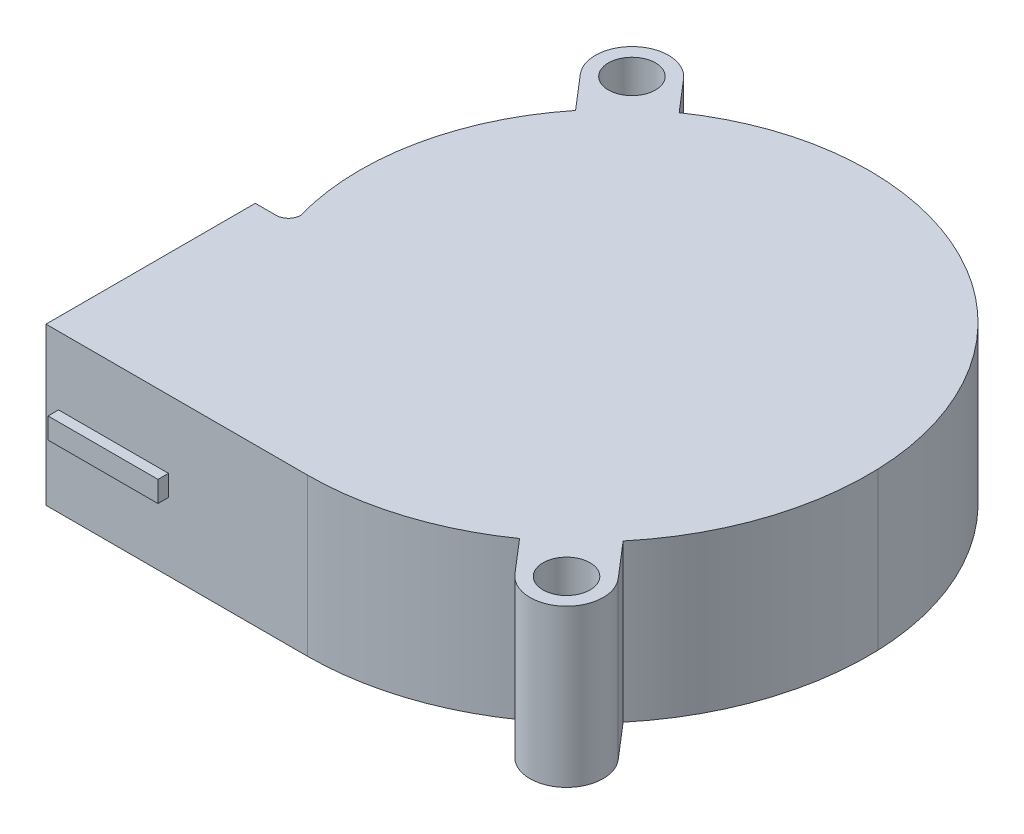
ISO-10303-21;
HEADER;
FILE_DESCRIPTION(('STEP AP214'),'2;1');
FILE_NAME('part.step','',(''),(''),'','','');
FILE_SCHEMA(('AUTOMOTIVE_DESIGN { 1 0 10303 214 1 1 1 1 }'));
ENDSEC;
DATA;
#1=APPLICATION_CONTEXT('core data for automotive mechanical design processes');
#2=APPLICATION_PROTOCOL_DEFINITION('international standard','automotive_design',2000,#1);
#3=PRODUCT_CONTEXT('',#1,'mechanical');
#4=PRODUCT('Part','Part','',(#3));
#5=PRODUCT_RELATED_PRODUCT_CATEGORY('part','',(#4));
#6=PRODUCT_DEFINITION_FORMATION('','',#4);
#7=PRODUCT_DEFINITION_CONTEXT('part definition',#1,'design');
#8=PRODUCT_DEFINITION('design','',#6,#7);
#9=PRODUCT_DEFINITION_SHAPE('','',#8);
#10=(LENGTH_UNIT() NAMED_UNIT(*) SI_UNIT(.MILLI.,.METRE.));
#11=(NAMED_UNIT(*) PLANE_ANGLE_UNIT() SI_UNIT($,.RADIAN.));
#12=(NAMED_UNIT(*) SI_UNIT($,.STERADIAN.) SOLID_ANGLE_UNIT());
#13=UNCERTAINTY_MEASURE_WITH_UNIT(LENGTH_MEASURE(1.E-05),#10,'distance_accuracy_value','');
#14=(GEOMETRIC_REPRESENTATION_CONTEXT(3) GLOBAL_UNCERTAINTY_ASSIGNED_CONTEXT((#13)) GLOBAL_UNIT_ASSIGNED_CONTEXT((#10,
#11,#12)) REPRESENTATION_CONTEXT('',''));
#15=CARTESIAN_POINT('',(0.,0.,0.));
#16=DIRECTION('',(0.,0.,1.));
#17=DIRECTION('',(1.,0.,0.));
#18=AXIS2_PLACEMENT_3D('',#15,#16,#17);
#19=CARTESIAN_POINT('',(0.,-7.5,27.75));
#20=DIRECTION('',(0.,0.,1.));
#21=DIRECTION('',(1.,0.,0.));
#22=AXIS2_PLACEMENT_3D('',#19,#20,#21);
#23=PLANE('',#22);
#24=DIRECTION('',(0.,1.,0.));
#25=VECTOR('',#24,1.);
#26=CARTESIAN_POINT('',(0.,-7.5,27.75));
#27=LINE('',#26,#25);
#28=CARTESIAN_POINT('',(0.,-7.5,27.75));
#29=VERTEX_POINT('',#28);
#30=CARTESIAN_POINT('',(0.,7.5,27.75));
#31=VERTEX_POINT('',#30);
#32=EDGE_CURVE('E484',#29,#31,#27,.T.);
#33=ORIENTED_EDGE('',*,*,#32,.T.);
#34=DIRECTION('',(1.,0.,0.));
#35=VECTOR('',#34,1.);
#36=CARTESIAN_POINT('',(0.,7.5,27.75));
#37=LINE('',#36,#35);
#38=CARTESIAN_POINT('',(-25.,7.5,27.75));
#39=VERTEX_POINT('',#38);
#40=EDGE_CURVE('E371',#39,#31,#37,.T.);
#41=ORIENTED_EDGE('',*,*,#40,.F.);
#42=DIRECTION('',(0.,1.,0.));
#43=VECTOR('',#42,1.);
#44=CARTESIAN_POINT('',(-25.,-7.5,27.75));
#45=LINE('',#44,#43);
#46=CARTESIAN_POINT('',(-25.,-7.5,27.75));
#47=VERTEX_POINT('',#46);
#48=EDGE_CURVE('E486',#47,#39,#45,.T.);
#49=ORIENTED_EDGE('',*,*,#48,.F.);
#50=DIRECTION('',(1.,0.,0.));
#51=VECTOR('',#50,1.);
#52=CARTESIAN_POINT('',(0.,-7.5,27.75));
#53=LINE('',#52,#51);
#54=EDGE_CURVE('E424',#47,#29,#53,.T.);
#55=ORIENTED_EDGE('',*,*,#54,.T.);
#56=EDGE_LOOP('',(#33,#41,#49,#55));
#57=FACE_BOUND('',#56,.T.);
#58=DIRECTION('',(0.,1.,0.));
#59=VECTOR('',#58,1.);
#60=CARTESIAN_POINT('',(-13.3,-1.,27.75));
#61=LINE('',#60,#59);
#62=CARTESIAN_POINT('',(-13.3,-1.,27.75));
#63=VERTEX_POINT('',#62);
#64=CARTESIAN_POINT('',(-13.3,1.,27.75));
#65=VERTEX_POINT('',#64);
#66=EDGE_CURVE('E54',#63,#65,#61,.T.);
#67=ORIENTED_EDGE('',*,*,#66,.F.);
#68=DIRECTION('',(-1.,0.,0.));
#69=VECTOR('',#68,1.);
#70=CARTESIAN_POINT('',(-23.8,-1.,27.75));
#71=LINE('',#70,#69);
#72=CARTESIAN_POINT('',(-23.8,-1.,27.75));
#73=VERTEX_POINT('',#72);
#74=EDGE_CURVE('E49',#63,#73,#71,.T.);
#75=ORIENTED_EDGE('',*,*,#74,.T.);
#76=DIRECTION('',(0.,1.,0.));
#77=VECTOR('',#76,1.);
#78=CARTESIAN_POINT('',(-23.8,-1.,27.75));
#79=LINE('',#78,#77);
#80=CARTESIAN_POINT('',(-23.8,1.,27.75));
#81=VERTEX_POINT('',#80);
#82=EDGE_CURVE('E232',#73,#81,#79,.T.);
#83=ORIENTED_EDGE('',*,*,#82,.T.);
#84=DIRECTION('',(-1.,0.,0.));
#85=VECTOR('',#84,1.);
#86=CARTESIAN_POINT('',(-23.8,1.,27.75));
#87=LINE('',#86,#85);
#88=EDGE_CURVE('E221',#65,#81,#87,.T.);
#89=ORIENTED_EDGE('',*,*,#88,.F.);
#90=EDGE_LOOP('',(#67,#75,#83,#89));
#91=FACE_BOUND('',#90,.T.);
#92=ADVANCED_FACE('F34',(#57,#91),#23,.T.);
#93=CARTESIAN_POINT('',(1.28434065934066,-7.5,0.));
#94=DIRECTION('',(0.,1.,0.));
#95=DIRECTION('',(0.,0.,1.));
#96=AXIS2_PLACEMENT_3D('',#93,#94,#95);
#97=CYLINDRICAL_SURFACE('',#96,24.0343406593407);
#98=DIRECTION('',(0.,1.,0.));
#99=VECTOR('',#98,1.);
#100=CARTESIAN_POINT('',(-22.3712512996283,-2.,4.25));
#101=LINE('',#100,#99);
#102=CARTESIAN_POINT('',(-22.3712512996283,-2.,4.25));
#103=VERTEX_POINT('',#102);
#104=CARTESIAN_POINT('',(-22.3712512996283,1.,4.25));
#105=VERTEX_POINT('',#104);
#106=EDGE_CURVE('E508',#103,#105,#101,.T.);
#107=ORIENTED_EDGE('',*,*,#106,.F.);
#108=CARTESIAN_POINT('',(1.28434065934066,-2.,0.));
#109=DIRECTION('',(0.,1.,0.));
#110=DIRECTION('',(0.,0.,1.));
#111=AXIS2_PLACEMENT_3D('',#108,#109,#110);
#112=CIRCLE('',#111,24.0343406593407);
#113=CARTESIAN_POINT('',(-22.75,-2.,0.));
#114=VERTEX_POINT('',#113);
#115=EDGE_CURVE('E506',#103,#114,#112,.F.);
#116=ORIENTED_EDGE('',*,*,#115,.T.);
#117=DIRECTION('',(0.,1.,0.));
#118=VECTOR('',#117,1.);
#119=CARTESIAN_POINT('',(-22.75,-7.5,0.));
#120=LINE('',#119,#118);
#121=CARTESIAN_POINT('',(-22.75,-7.5,0.));
#122=VERTEX_POINT('',#121);
#123=EDGE_CURVE('E460',#122,#114,#120,.T.);
#124=ORIENTED_EDGE('',*,*,#123,.F.);
#125=CARTESIAN_POINT('',(1.28434065934066,-7.5,0.));
#126=DIRECTION('',(0.,1.,0.));
#127=DIRECTION('',(0.,0.,1.));
#128=AXIS2_PLACEMENT_3D('',#125,#126,#127);
#129=CIRCLE('',#128,24.0343406593407);
#130=CARTESIAN_POINT('',(-21.8313535095817,-7.5,6.58135350958172));
#131=VERTEX_POINT('',#130);
#132=EDGE_CURVE('E415',#122,#131,#129,.T.);
#133=ORIENTED_EDGE('',*,*,#132,.T.);
#134=DIRECTION('',(0.,1.,0.));
#135=VECTOR('',#134,1.);
#136=CARTESIAN_POINT('',(-21.8313535095817,-7.5,6.58135350958172));
#137=LINE('',#136,#135);
#138=CARTESIAN_POINT('',(-21.8313535095817,7.5,6.58135350958172));
#139=VERTEX_POINT('',#138);
#140=EDGE_CURVE('E357',#131,#139,#137,.T.);
#141=ORIENTED_EDGE('',*,*,#140,.T.);
#142=CARTESIAN_POINT('',(1.28434065934066,7.5,0.));
#143=DIRECTION('',(0.,1.,0.));
#144=DIRECTION('',(0.,0.,1.));
#145=AXIS2_PLACEMENT_3D('',#142,#143,#144);
#146=CIRCLE('',#145,24.0343406593407);
#147=CARTESIAN_POINT('',(-22.75,7.5,0.));
#148=VERTEX_POINT('',#147);
#149=EDGE_CURVE('E367',#148,#139,#146,.T.);
#150=ORIENTED_EDGE('',*,*,#149,.F.);
#151=CARTESIAN_POINT('',(-22.75,1.,0.));
#152=VERTEX_POINT('',#151);
#153=EDGE_CURVE('E463',#152,#148,#120,.T.);
#154=ORIENTED_EDGE('',*,*,#153,.F.);
#155=CARTESIAN_POINT('',(1.28434065934066,1.,0.));
#156=DIRECTION('',(0.,1.,0.));
#157=DIRECTION('',(0.,0.,1.));
#158=AXIS2_PLACEMENT_3D('',#155,#156,#157);
#159=CIRCLE('',#158,24.0343406593407);
#160=EDGE_CURVE('E495',#105,#152,#159,.F.);
#161=ORIENTED_EDGE('',*,*,#160,.F.);
#162=EDGE_LOOP('',(#107,#116,#124,#133,#141,#150,#154,#161));
#163=FACE_BOUND('',#162,.T.);
#164=ADVANCED_FACE('F36',(#163),#97,.T.);
#165=CARTESIAN_POINT('',(1.54945054945054,-7.5,0.));
#166=DIRECTION('',(0.,1.,0.));
#167=DIRECTION('',(0.,0.,1.));
#168=AXIS2_PLACEMENT_3D('',#165,#166,#167);
#169=CYLINDRICAL_SURFACE('',#168,24.2994505494505);
#170=ORIENTED_EDGE('',*,*,#123,.T.);
#171=CARTESIAN_POINT('',(1.54945054945054,-2.,0.));
#172=DIRECTION('',(0.,1.,0.));
#173=DIRECTION('',(0.,0.,1.));
#174=AXIS2_PLACEMENT_3D('',#171,#172,#173);
#175=CIRCLE('',#174,24.2994505494505);
#176=CARTESIAN_POINT('',(-22.3754485518036,-2.,-4.25));
#177=VERTEX_POINT('',#176);
#178=EDGE_CURVE('E11',#114,#177,#175,.F.);
#179=ORIENTED_EDGE('',*,*,#178,.T.);
#180=DIRECTION('',(0.,1.,0.));
#181=VECTOR('',#180,1.);
#182=CARTESIAN_POINT('',(-22.3754485518036,-2.,-4.25));
#183=LINE('',#182,#181);
#184=CARTESIAN_POINT('',(-22.3754485518036,1.,-4.25));
#185=VERTEX_POINT('',#184);
#186=EDGE_CURVE('E500',#177,#185,#183,.T.);
#187=ORIENTED_EDGE('',*,*,#186,.T.);
#188=CARTESIAN_POINT('',(1.54945054945054,1.,0.));
#189=DIRECTION('',(0.,1.,0.));
#190=DIRECTION('',(0.,0.,1.));
#191=AXIS2_PLACEMENT_3D('',#188,#189,#190);
#192=CIRCLE('',#191,24.2994505494505);
#193=EDGE_CURVE('E42',#152,#185,#192,.F.);
#194=ORIENTED_EDGE('',*,*,#193,.F.);
#195=ORIENTED_EDGE('',*,*,#153,.T.);
#196=CARTESIAN_POINT('',(1.54945054945054,7.5,0.));
#197=DIRECTION('',(0.,1.,0.));
#198=DIRECTION('',(0.,0.,-1.));
#199=AXIS2_PLACEMENT_3D('',#196,#197,#198);
#200=CIRCLE('',#199,24.2994505494505);
#201=CARTESIAN_POINT('',(-17.377967792775,7.5,-15.2386394374162));
#202=VERTEX_POINT('',#201);
#203=EDGE_CURVE('E407',#202,#148,#200,.T.);
#204=ORIENTED_EDGE('',*,*,#203,.F.);
#205=DIRECTION('',(0.,1.,0.));
#206=VECTOR('',#205,1.);
#207=CARTESIAN_POINT('',(-17.377967792775,-7.5,-15.2386394374162));
#208=LINE('',#207,#206);
#209=CARTESIAN_POINT('',(-17.377967792775,-7.5,-15.2386394374162));
#210=VERTEX_POINT('',#209);
#211=EDGE_CURVE('E464',#210,#202,#208,.T.);
#212=ORIENTED_EDGE('',*,*,#211,.F.);
#213=CARTESIAN_POINT('',(1.54945054945054,-7.5,0.));
#214=DIRECTION('',(0.,1.,0.));
#215=DIRECTION('',(0.,0.,-1.));
#216=AXIS2_PLACEMENT_3D('',#213,#214,#215);
#217=CIRCLE('',#216,24.2994505494505);
#218=EDGE_CURVE('E457',#210,#122,#217,.T.);
#219=ORIENTED_EDGE('',*,*,#218,.T.);
#220=EDGE_LOOP('',(#170,#179,#187,#194,#195,#204,#212,#219));
#221=FACE_BOUND('',#220,.T.);
#222=ADVANCED_FACE('F287',(#221),#169,.T.);
#223=CARTESIAN_POINT('',(-20.1542378361623,-7.5,-18.4685483767819));
#224=DIRECTION('',(-0.758353667474934,0.,0.651843320919466));
#225=DIRECTION('',(0.651843320919466,0.,0.758353667474934));
#226=AXIS2_PLACEMENT_3D('',#223,#224,#225);
#227=PLANE('',#226);
#228=ORIENTED_EDGE('',*,*,#211,.T.);
#229=DIRECTION('',(0.651843320919466,0.,0.758353667474934));
#230=VECTOR('',#229,1.);
#231=CARTESIAN_POINT('',(-20.1542378361623,7.5,-18.4685483767819));
#232=LINE('',#231,#230);
#233=CARTESIAN_POINT('',(-20.1542378361623,7.5,-18.4685483767819));
#234=VERTEX_POINT('',#233);
#235=EDGE_CURVE('E404',#234,#202,#232,.T.);
#236=ORIENTED_EDGE('',*,*,#235,.F.);
#237=DIRECTION('',(0.,1.,0.));
#238=VECTOR('',#237,1.);
#239=CARTESIAN_POINT('',(-20.1542378361623,-7.5,-18.4685483767819));
#240=LINE('',#239,#238);
#241=CARTESIAN_POINT('',(-20.1542378361623,-7.5,-18.4685483767819));
#242=VERTEX_POINT('',#241);
#243=EDGE_CURVE('E466',#242,#234,#240,.T.);
#244=ORIENTED_EDGE('',*,*,#243,.F.);
#245=DIRECTION('',(0.651843320919466,0.,0.758353667474934));
#246=VECTOR('',#245,1.);
#247=CARTESIAN_POINT('',(-20.1542378361623,-7.5,-18.4685483767819));
#248=LINE('',#247,#246);
#249=EDGE_CURVE('E454',#242,#210,#248,.T.);
#250=ORIENTED_EDGE('',*,*,#249,.T.);
#251=EDGE_LOOP('',(#228,#236,#244,#250));
#252=FACE_BOUND('',#251,.T.);
#253=ADVANCED_FACE('F290',(#252),#227,.T.);
#254=CARTESIAN_POINT('',(-17.5,-7.5,-20.75));
#255=DIRECTION('',(0.,1.,0.));
#256=DIRECTION('',(0.,0.,1.));
#257=AXIS2_PLACEMENT_3D('',#254,#255,#256);
#258=CYLINDRICAL_SURFACE('',#257,3.5);
#259=ORIENTED_EDGE('',*,*,#243,.T.);
#260=CARTESIAN_POINT('',(-17.5,7.5,-20.75));
#261=DIRECTION('',(0.,1.,0.));
#262=DIRECTION('',(0.,0.,1.));
#263=AXIS2_PLACEMENT_3D('',#260,#261,#262);
#264=CIRCLE('',#263,3.5);
#265=CARTESIAN_POINT('',(-14.8457621638377,7.5,-23.0314516232181));
#266=VERTEX_POINT('',#265);
#267=EDGE_CURVE('E401',#266,#234,#264,.T.);
#268=ORIENTED_EDGE('',*,*,#267,.F.);
#269=DIRECTION('',(0.,1.,0.));
#270=VECTOR('',#269,1.);
#271=CARTESIAN_POINT('',(-14.8457621638377,-7.5,-23.0314516232181));
#272=LINE('',#271,#270);
#273=CARTESIAN_POINT('',(-14.8457621638377,-7.5,-23.0314516232181));
#274=VERTEX_POINT('',#273);
#275=EDGE_CURVE('E468',#274,#266,#272,.T.);
#276=ORIENTED_EDGE('',*,*,#275,.F.);
#277=CARTESIAN_POINT('',(-17.5,-7.5,-20.75));
#278=DIRECTION('',(0.,1.,0.));
#279=DIRECTION('',(0.,0.,1.));
#280=AXIS2_PLACEMENT_3D('',#277,#278,#279);
#281=CIRCLE('',#280,3.5);
#282=EDGE_CURVE('E451',#274,#242,#281,.T.);
#283=ORIENTED_EDGE('',*,*,#282,.T.);
#284=EDGE_LOOP('',(#259,#268,#276,#283));
#285=FACE_BOUND('',#284,.T.);
#286=ADVANCED_FACE('F294',(#285),#258,.T.);
#287=CARTESIAN_POINT('',(-14.8457621638377,-7.5,-23.0314516232181));
#288=DIRECTION('',(0.758353667474934,0.,-0.651843320919466));
#289=DIRECTION('',(-0.651843320919466,0.,-0.758353667474934));
#290=AXIS2_PLACEMENT_3D('',#287,#288,#289);
#291=PLANE('',#290);
#292=ORIENTED_EDGE('',*,*,#275,.T.);
#293=DIRECTION('',(-0.651843320919466,0.,-0.758353667474934));
#294=VECTOR('',#293,1.);
#295=CARTESIAN_POINT('',(-14.8457621638377,7.5,-23.0314516232181));
#296=LINE('',#295,#294);
#297=CARTESIAN_POINT('',(-12.2442886819954,7.5,-20.0049007750617));
#298=VERTEX_POINT('',#297);
#299=EDGE_CURVE('E398',#298,#266,#296,.T.);
#300=ORIENTED_EDGE('',*,*,#299,.F.);
#301=DIRECTION('',(0.,1.,0.));
#302=VECTOR('',#301,1.);
#303=CARTESIAN_POINT('',(-12.2442886819954,-7.5,-20.0049007750617));
#304=LINE('',#303,#302);
#305=CARTESIAN_POINT('',(-12.2442886819954,-7.5,-20.0049007750617));
#306=VERTEX_POINT('',#305);
#307=EDGE_CURVE('E470',#306,#298,#304,.T.);
#308=ORIENTED_EDGE('',*,*,#307,.F.);
#309=DIRECTION('',(-0.651843320919466,0.,-0.758353667474934));
#310=VECTOR('',#309,1.);
#311=CARTESIAN_POINT('',(-14.8457621638377,-7.5,-23.0314516232181));
#312=LINE('',#311,#310);
#313=EDGE_CURVE('E448',#306,#274,#312,.T.);
#314=ORIENTED_EDGE('',*,*,#313,.T.);
#315=EDGE_LOOP('',(#292,#300,#308,#314));
#316=FACE_BOUND('',#315,.T.);
#317=ADVANCED_FACE('F298',(#316),#291,.T.);
#318=CARTESIAN_POINT('',(1.54945054945054,-7.5,0.));
#319=DIRECTION('',(0.,1.,0.));
#320=DIRECTION('',(0.,0.,1.));
#321=AXIS2_PLACEMENT_3D('',#318,#319,#320);
#322=CYLINDRICAL_SURFACE('',#321,24.2994505494505);
#323=ORIENTED_EDGE('',*,*,#307,.T.);
#324=CARTESIAN_POINT('',(1.54945054945054,7.5,0.));
#325=DIRECTION('',(0.,1.,0.));
#326=DIRECTION('',(0.,0.,-1.));
#327=AXIS2_PLACEMENT_3D('',#324,#325,#326);
#328=CIRCLE('',#327,24.2994505494505);
#329=CARTESIAN_POINT('',(0.,7.5,-24.25));
#330=VERTEX_POINT('',#329);
#331=EDGE_CURVE('E395',#330,#298,#328,.T.);
#332=ORIENTED_EDGE('',*,*,#331,.F.);
#333=DIRECTION('',(0.,1.,0.));
#334=VECTOR('',#333,1.);
#335=CARTESIAN_POINT('',(0.,-7.5,-24.25));
#336=LINE('',#335,#334);
#337=CARTESIAN_POINT('',(0.,-7.5,-24.25));
#338=VERTEX_POINT('',#337);
#339=EDGE_CURVE('E472',#338,#330,#336,.T.);
#340=ORIENTED_EDGE('',*,*,#339,.F.);
#341=CARTESIAN_POINT('',(1.54945054945054,-7.5,0.));
#342=DIRECTION('',(0.,1.,0.));
#343=DIRECTION('',(0.,0.,-1.));
#344=AXIS2_PLACEMENT_3D('',#341,#342,#343);
#345=CIRCLE('',#344,24.2994505494505);
#346=EDGE_CURVE('E445',#338,#306,#345,.T.);
#347=ORIENTED_EDGE('',*,*,#346,.T.);
#348=EDGE_LOOP('',(#323,#332,#340,#347));
#349=FACE_BOUND('',#348,.T.);
#350=ADVANCED_FACE('F302',(#349),#322,.T.);
#351=CARTESIAN_POINT('',(1.60434425415708,-7.5,0.859125410362815));
#352=DIRECTION('',(0.,1.,0.));
#353=DIRECTION('',(0.,0.,1.));
#354=AXIS2_PLACEMENT_3D('',#351,#352,#353);
#355=CYLINDRICAL_SURFACE('',#354,25.1603278865593);
#356=ORIENTED_EDGE('',*,*,#339,.T.);
#357=CARTESIAN_POINT('',(1.60434425415708,7.5,0.859125410362815));
#358=DIRECTION('',(0.,1.,0.));
#359=DIRECTION('',(0.,0.,-1.));
#360=AXIS2_PLACEMENT_3D('',#357,#358,#359);
#361=CIRCLE('',#360,25.1603278865593);
#362=CARTESIAN_POINT('',(26.75,7.5,0.));
#363=VERTEX_POINT('',#362);
#364=EDGE_CURVE('E392',#363,#330,#361,.T.);
#365=ORIENTED_EDGE('',*,*,#364,.F.);
#366=DIRECTION('',(0.,1.,0.));
#367=VECTOR('',#366,1.);
#368=CARTESIAN_POINT('',(26.75,-7.5,0.));
#369=LINE('',#368,#367);
#370=CARTESIAN_POINT('',(26.75,-7.5,0.));
#371=VERTEX_POINT('',#370);
#372=EDGE_CURVE('E474',#371,#363,#369,.T.);
#373=ORIENTED_EDGE('',*,*,#372,.F.);
#374=CARTESIAN_POINT('',(1.60434425415708,-7.5,0.859125410362815));
#375=DIRECTION('',(0.,1.,0.));
#376=DIRECTION('',(0.,0.,-1.));
#377=AXIS2_PLACEMENT_3D('',#374,#375,#376);
#378=CIRCLE('',#377,25.1603278865593);
#379=EDGE_CURVE('E442',#371,#338,#378,.T.);
#380=ORIENTED_EDGE('',*,*,#379,.T.);
#381=EDGE_LOOP('',(#356,#365,#373,#380));
#382=FACE_BOUND('',#381,.T.);
#383=ADVANCED_FACE('F306',(#382),#355,.T.);
#384=CARTESIAN_POINT('',(-0.0681700971297411,-7.5,0.916268464928992));
#385=DIRECTION('',(0.,1.,0.));
#386=DIRECTION('',(0.,0.,1.));
#387=AXIS2_PLACEMENT_3D('',#384,#385,#386);
#388=CYLINDRICAL_SURFACE('',#387,26.8338181267297);
#389=ORIENTED_EDGE('',*,*,#372,.T.);
#390=CARTESIAN_POINT('',(-0.0681700971297411,7.5,0.916268464928992));
#391=DIRECTION('',(0.,1.,0.));
#392=DIRECTION('',(0.,0.,-1.));
#393=AXIS2_PLACEMENT_3D('',#390,#391,#392);
#394=CIRCLE('',#393,26.8338181267297);
#395=CARTESIAN_POINT('',(20.5255717911937,7.5,18.1195120630276));
#396=VERTEX_POINT('',#395);
#397=EDGE_CURVE('E389',#396,#363,#394,.T.);
#398=ORIENTED_EDGE('',*,*,#397,.F.);
#399=DIRECTION('',(0.,1.,0.));
#400=VECTOR('',#399,1.);
#401=CARTESIAN_POINT('',(20.5255717911937,-7.5,18.1195120630276));
#402=LINE('',#401,#400);
#403=CARTESIAN_POINT('',(20.5255717911937,-7.5,18.1195120630276));
#404=VERTEX_POINT('',#403);
#405=EDGE_CURVE('E476',#404,#396,#402,.T.);
#406=ORIENTED_EDGE('',*,*,#405,.F.);
#407=CARTESIAN_POINT('',(-0.0681700971297411,-7.5,0.916268464928992));
#408=DIRECTION('',(0.,1.,0.));
#409=DIRECTION('',(0.,0.,-1.));
#410=AXIS2_PLACEMENT_3D('',#407,#408,#409);
#411=CIRCLE('',#410,26.8338181267297);
#412=EDGE_CURVE('E439',#404,#371,#411,.T.);
#413=ORIENTED_EDGE('',*,*,#412,.T.);
#414=EDGE_LOOP('',(#389,#398,#406,#413));
#415=FACE_BOUND('',#414,.T.);
#416=ADVANCED_FACE('F310',(#415),#388,.T.);
#417=CARTESIAN_POINT('',(20.5255717911937,-7.5,18.1195120630276));
#418=DIRECTION('',(0.758353667474934,0.,-0.651843320919465));
#419=DIRECTION('',(-0.651843320919466,0.,-0.758353667474934));
#420=AXIS2_PLACEMENT_3D('',#417,#418,#419);
#421=PLANE('',#420);
#422=ORIENTED_EDGE('',*,*,#405,.T.);
#423=DIRECTION('',(-0.651843320919466,0.,-0.758353667474934));
#424=VECTOR('',#423,1.);
#425=CARTESIAN_POINT('',(20.5255717911937,7.5,18.1195120630276));
#426=LINE('',#425,#424);
#427=CARTESIAN_POINT('',(23.4042378361623,7.5,21.4685483767819));
#428=VERTEX_POINT('',#427);
#429=EDGE_CURVE('E386',#428,#396,#426,.T.);
#430=ORIENTED_EDGE('',*,*,#429,.F.);
#431=DIRECTION('',(0.,1.,0.));
#432=VECTOR('',#431,1.);
#433=CARTESIAN_POINT('',(23.4042378361623,-7.5,21.4685483767819));
#434=LINE('',#433,#432);
#435=CARTESIAN_POINT('',(23.4042378361623,-7.5,21.4685483767819));
#436=VERTEX_POINT('',#435);
#437=EDGE_CURVE('E478',#436,#428,#434,.T.);
#438=ORIENTED_EDGE('',*,*,#437,.F.);
#439=DIRECTION('',(-0.651843320919466,0.,-0.758353667474934));
#440=VECTOR('',#439,1.);
#441=CARTESIAN_POINT('',(20.5255717911937,-7.5,18.1195120630276));
#442=LINE('',#441,#440);
#443=EDGE_CURVE('E436',#436,#404,#442,.T.);
#444=ORIENTED_EDGE('',*,*,#443,.T.);
#445=EDGE_LOOP('',(#422,#430,#438,#444));
#446=FACE_BOUND('',#445,.T.);
#447=ADVANCED_FACE('F314',(#446),#421,.T.);
#448=CARTESIAN_POINT('',(20.75,-7.5,23.75));
#449=DIRECTION('',(0.,1.,0.));
#450=DIRECTION('',(0.,0.,1.));
#451=AXIS2_PLACEMENT_3D('',#448,#449,#450);
#452=CYLINDRICAL_SURFACE('',#451,3.5);
#453=ORIENTED_EDGE('',*,*,#437,.T.);
#454=CARTESIAN_POINT('',(20.75,7.5,23.75));
#455=DIRECTION('',(0.,1.,0.));
#456=DIRECTION('',(0.,0.,1.));
#457=AXIS2_PLACEMENT_3D('',#454,#455,#456);
#458=CIRCLE('',#457,3.5);
#459=CARTESIAN_POINT('',(18.0957621638377,7.5,26.0314516232181));
#460=VERTEX_POINT('',#459);
#461=EDGE_CURVE('E383',#460,#428,#458,.T.);
#462=ORIENTED_EDGE('',*,*,#461,.F.);
#463=DIRECTION('',(0.,1.,0.));
#464=VECTOR('',#463,1.);
#465=CARTESIAN_POINT('',(18.0957621638377,-7.5,26.0314516232181));
#466=LINE('',#465,#464);
#467=CARTESIAN_POINT('',(18.0957621638377,-7.5,26.0314516232181));
#468=VERTEX_POINT('',#467);
#469=EDGE_CURVE('E480',#468,#460,#466,.T.);
#470=ORIENTED_EDGE('',*,*,#469,.F.);
#471=CARTESIAN_POINT('',(20.75,-7.5,23.75));
#472=DIRECTION('',(0.,1.,0.));
#473=DIRECTION('',(0.,0.,1.));
#474=AXIS2_PLACEMENT_3D('',#471,#472,#473);
#475=CIRCLE('',#474,3.5);
#476=EDGE_CURVE('E433',#468,#436,#475,.T.);
#477=ORIENTED_EDGE('',*,*,#476,.T.);
#478=EDGE_LOOP('',(#453,#462,#470,#477));
#479=FACE_BOUND('',#478,.T.);
#480=ADVANCED_FACE('F318',(#479),#452,.T.);
#481=CARTESIAN_POINT('',(15.3721482158609,-7.5,22.8628027164215));
#482=DIRECTION('',(-0.758353667474934,0.,0.651843320919465));
#483=DIRECTION('',(0.651843320919465,0.,0.758353667474934));
#484=AXIS2_PLACEMENT_3D('',#481,#482,#483);
#485=PLANE('',#484);
#486=ORIENTED_EDGE('',*,*,#469,.T.);
#487=DIRECTION('',(0.651843320919465,0.,0.758353667474934));
#488=VECTOR('',#487,1.);
#489=CARTESIAN_POINT('',(15.3721482158609,7.5,22.8628027164215));
#490=LINE('',#489,#488);
#491=CARTESIAN_POINT('',(15.3721482158609,7.5,22.8628027164215));
#492=VERTEX_POINT('',#491);
#493=EDGE_CURVE('E380',#492,#460,#490,.T.);
#494=ORIENTED_EDGE('',*,*,#493,.F.);
#495=DIRECTION('',(0.,1.,0.));
#496=VECTOR('',#495,1.);
#497=CARTESIAN_POINT('',(15.3721482158609,-7.5,22.8628027164215));
#498=LINE('',#497,#496);
#499=CARTESIAN_POINT('',(15.3721482158609,-7.5,22.8628027164215));
#500=VERTEX_POINT('',#499);
#501=EDGE_CURVE('E482',#500,#492,#498,.T.);
#502=ORIENTED_EDGE('',*,*,#501,.F.);
#503=DIRECTION('',(0.651843320919465,0.,0.758353667474934));
#504=VECTOR('',#503,1.);
#505=CARTESIAN_POINT('',(15.3721482158609,-7.5,22.8628027164215));
#506=LINE('',#505,#504);
#507=EDGE_CURVE('E430',#500,#468,#506,.T.);
#508=ORIENTED_EDGE('',*,*,#507,.T.);
#509=EDGE_LOOP('',(#486,#494,#502,#508));
#510=FACE_BOUND('',#509,.T.);
#511=ADVANCED_FACE('F322',(#510),#485,.T.);
#512=CARTESIAN_POINT('',(-0.0681700971297411,-7.5,0.916268464928992));
#513=DIRECTION('',(0.,1.,0.));
#514=DIRECTION('',(0.,0.,1.));
#515=AXIS2_PLACEMENT_3D('',#512,#513,#514);
#516=CYLINDRICAL_SURFACE('',#515,26.8338181267297);
#517=ORIENTED_EDGE('',*,*,#501,.T.);
#518=CARTESIAN_POINT('',(-0.0681700971297411,7.5,0.916268464928992));
#519=DIRECTION('',(0.,1.,0.));
#520=DIRECTION('',(0.,0.,-1.));
#521=AXIS2_PLACEMENT_3D('',#518,#519,#520);
#522=CIRCLE('',#521,26.8338181267297);
#523=EDGE_CURVE('E377',#31,#492,#522,.T.);
#524=ORIENTED_EDGE('',*,*,#523,.F.);
#525=ORIENTED_EDGE('',*,*,#32,.F.);
#526=CARTESIAN_POINT('',(-0.0681700971297411,-7.5,0.916268464928992));
#527=DIRECTION('',(0.,1.,0.));
#528=DIRECTION('',(0.,0.,-1.));
#529=AXIS2_PLACEMENT_3D('',#526,#527,#528);
#530=CIRCLE('',#529,26.8338181267297);
#531=EDGE_CURVE('E427',#29,#500,#530,.T.);
#532=ORIENTED_EDGE('',*,*,#531,.T.);
#533=EDGE_LOOP('',(#517,#524,#525,#532));
#534=FACE_BOUND('',#533,.T.);
#535=ADVANCED_FACE('F326',(#534),#516,.T.);
#536=CARTESIAN_POINT('',(-25.,-7.5,27.75));
#537=DIRECTION('',(-1.,0.,0.));
#538=DIRECTION('',(0.,0.,1.));
#539=AXIS2_PLACEMENT_3D('',#536,#537,#538);
#540=PLANE('',#539);
#541=ORIENTED_EDGE('',*,*,#48,.T.);
#542=DIRECTION('',(0.,0.,1.));
#543=VECTOR('',#542,1.);
#544=CARTESIAN_POINT('',(-25.,7.5,27.75));
#545=LINE('',#544,#543);
#546=CARTESIAN_POINT('',(-25.,7.5,7.75));
#547=VERTEX_POINT('',#546);
#548=EDGE_CURVE('E369',#547,#39,#545,.T.);
#549=ORIENTED_EDGE('',*,*,#548,.F.);
#550=DIRECTION('',(0.,1.,0.));
#551=VECTOR('',#550,1.);
#552=CARTESIAN_POINT('',(-25.,-7.5,7.75));
#553=LINE('',#552,#551);
#554=CARTESIAN_POINT('',(-25.,-7.5,7.75));
#555=VERTEX_POINT('',#554);
#556=EDGE_CURVE('E356',#555,#547,#553,.T.);
#557=ORIENTED_EDGE('',*,*,#556,.F.);
#558=DIRECTION('',(0.,0.,1.));
#559=VECTOR('',#558,1.);
#560=CARTESIAN_POINT('',(-25.,-7.5,27.75));
#561=LINE('',#560,#559);
#562=EDGE_CURVE('E421',#555,#47,#561,.T.);
#563=ORIENTED_EDGE('',*,*,#562,.T.);
#564=EDGE_LOOP('',(#541,#549,#557,#563));
#565=FACE_BOUND('',#564,.T.);
#566=ADVANCED_FACE('F330',(#565),#540,.T.);
#567=CARTESIAN_POINT('',(-23.,-7.5,7.75));
#568=DIRECTION('',(0.,0.,-1.));
#569=DIRECTION('',(-1.,0.,0.));
#570=AXIS2_PLACEMENT_3D('',#567,#568,#569);
#571=PLANE('',#570);
#572=ORIENTED_EDGE('',*,*,#556,.T.);
#573=DIRECTION('',(-1.,0.,0.));
#574=VECTOR('',#573,1.);
#575=CARTESIAN_POINT('',(-23.,7.5,7.75));
#576=LINE('',#575,#574);
#577=CARTESIAN_POINT('',(-23.,7.5,7.75));
#578=VERTEX_POINT('',#577);
#579=EDGE_CURVE('E363',#578,#547,#576,.T.);
#580=ORIENTED_EDGE('',*,*,#579,.F.);
#581=DIRECTION('',(0.,1.,0.));
#582=VECTOR('',#581,1.);
#583=CARTESIAN_POINT('',(-23.,-7.5,7.75));
#584=LINE('',#583,#582);
#585=CARTESIAN_POINT('',(-23.,-7.5,7.75));
#586=VERTEX_POINT('',#585);
#587=EDGE_CURVE('E347',#586,#578,#584,.T.);
#588=ORIENTED_EDGE('',*,*,#587,.F.);
#589=DIRECTION('',(-1.,0.,0.));
#590=VECTOR('',#589,1.);
#591=CARTESIAN_POINT('',(-23.,-7.5,7.75));
#592=LINE('',#591,#590);
#593=EDGE_CURVE('E419',#586,#555,#592,.T.);
#594=ORIENTED_EDGE('',*,*,#593,.T.);
#595=EDGE_LOOP('',(#572,#580,#588,#594));
#596=FACE_BOUND('',#595,.T.);
#597=ADVANCED_FACE('F337',(#596),#571,.T.);
#598=CARTESIAN_POINT('',(-23.,-7.5,6.58135350958172));
#599=DIRECTION('',(0.,1.,0.));
#600=DIRECTION('',(0.,0.,1.));
#601=AXIS2_PLACEMENT_3D('',#598,#599,#600);
#602=CYLINDRICAL_SURFACE('',#601,1.16864649041828);
#603=ORIENTED_EDGE('',*,*,#587,.T.);
#604=CARTESIAN_POINT('',(-23.,7.5,6.58135350958172));
#605=DIRECTION('',(0.,-1.,0.));
#606=DIRECTION('',(0.,0.,1.));
#607=AXIS2_PLACEMENT_3D('',#604,#605,#606);
#608=CIRCLE('',#607,1.16864649041828);
#609=EDGE_CURVE('E349',#139,#578,#608,.T.);
#610=ORIENTED_EDGE('',*,*,#609,.F.);
#611=ORIENTED_EDGE('',*,*,#140,.F.);
#612=CARTESIAN_POINT('',(-23.,-7.5,6.58135350958172));
#613=DIRECTION('',(0.,-1.,0.));
#614=DIRECTION('',(0.,0.,1.));
#615=AXIS2_PLACEMENT_3D('',#612,#613,#614);
#616=CIRCLE('',#615,1.16864649041828);
#617=EDGE_CURVE('E352',#131,#586,#616,.T.);
#618=ORIENTED_EDGE('',*,*,#617,.T.);
#619=EDGE_LOOP('',(#603,#610,#611,#618));
#620=FACE_BOUND('',#619,.T.);
#621=ADVANCED_FACE('F285',(#620),#602,.F.);
#622=CARTESIAN_POINT('',(1.28434065934066,-7.5,0.));
#623=DIRECTION('',(0.,1.,0.));
#624=DIRECTION('',(0.,0.,1.));
#625=AXIS2_PLACEMENT_3D('',#622,#623,#624);
#626=PLANE('',#625);
#627=CARTESIAN_POINT('',(20.75,-7.5,23.75));
#628=DIRECTION('',(0.,1.,0.));
#629=DIRECTION('',(0.,0.,1.));
#630=AXIS2_PLACEMENT_3D('',#627,#628,#629);
#631=CIRCLE('',#630,2.25);
#632=CARTESIAN_POINT('',(20.75,-7.5,26.));
#633=VERTEX_POINT('',#632);
#634=EDGE_CURVE('E409',#633,#633,#631,.T.);
#635=ORIENTED_EDGE('',*,*,#634,.T.);
#636=EDGE_LOOP('',(#635));
#637=FACE_BOUND('',#636,.T.);
#638=CARTESIAN_POINT('',(-17.5,-7.5,-20.75));
#639=DIRECTION('',(0.,1.,0.));
#640=DIRECTION('',(0.,0.,1.));
#641=AXIS2_PLACEMENT_3D('',#638,#639,#640);
#642=CIRCLE('',#641,2.25);
#643=CARTESIAN_POINT('',(-17.5,-7.5,-18.5));
#644=VERTEX_POINT('',#643);
#645=EDGE_CURVE('E412',#644,#644,#642,.T.);
#646=ORIENTED_EDGE('',*,*,#645,.T.);
#647=EDGE_LOOP('',(#646));
#648=FACE_BOUND('',#647,.T.);
#649=ORIENTED_EDGE('',*,*,#132,.F.);
#650=ORIENTED_EDGE('',*,*,#218,.F.);
#651=ORIENTED_EDGE('',*,*,#249,.F.);
#652=ORIENTED_EDGE('',*,*,#282,.F.);
#653=ORIENTED_EDGE('',*,*,#313,.F.);
#654=ORIENTED_EDGE('',*,*,#346,.F.);
#655=ORIENTED_EDGE('',*,*,#379,.F.);
#656=ORIENTED_EDGE('',*,*,#412,.F.);
#657=ORIENTED_EDGE('',*,*,#443,.F.);
#658=ORIENTED_EDGE('',*,*,#476,.F.);
#659=ORIENTED_EDGE('',*,*,#507,.F.);
#660=ORIENTED_EDGE('',*,*,#531,.F.);
#661=ORIENTED_EDGE('',*,*,#54,.F.);
#662=ORIENTED_EDGE('',*,*,#562,.F.);
#663=ORIENTED_EDGE('',*,*,#593,.F.);
#664=ORIENTED_EDGE('',*,*,#617,.F.);
#665=EDGE_LOOP('',(#649,#650,#651,#652,#653,#654,#655,#656,#657,#658,#659,#660,#661,#662,#663,#664));
#666=FACE_BOUND('',#665,.T.);
#667=ADVANCED_FACE('F281',(#637,#648,#666),#626,.F.);
#668=CARTESIAN_POINT('',(-17.5,-7.5,-20.75));
#669=DIRECTION('',(0.,1.,0.));
#670=DIRECTION('',(0.,0.,1.));
#671=AXIS2_PLACEMENT_3D('',#668,#669,#670);
#672=CYLINDRICAL_SURFACE('',#671,2.25);
#673=ORIENTED_EDGE('',*,*,#645,.F.);
#674=EDGE_LOOP('',(#673));
#675=FACE_BOUND('',#674,.T.);
#676=CARTESIAN_POINT('',(-17.5,7.5,-20.75));
#677=DIRECTION('',(0.,1.,0.));
#678=DIRECTION('',(0.,0.,1.));
#679=AXIS2_PLACEMENT_3D('',#676,#677,#678);
#680=CIRCLE('',#679,2.25);
#681=CARTESIAN_POINT('',(-17.5,7.5,-18.5));
#682=VERTEX_POINT('',#681);
#683=EDGE_CURVE('E519',#682,#682,#680,.T.);
#684=ORIENTED_EDGE('',*,*,#683,.T.);
#685=EDGE_LOOP('',(#684));
#686=FACE_BOUND('',#685,.T.);
#687=ADVANCED_FACE('F277',(#675,#686),#672,.F.);
#688=CARTESIAN_POINT('',(20.75,-7.5,23.75));
#689=DIRECTION('',(0.,1.,0.));
#690=DIRECTION('',(0.,0.,1.));
#691=AXIS2_PLACEMENT_3D('',#688,#689,#690);
#692=CYLINDRICAL_SURFACE('',#691,2.25);
#693=ORIENTED_EDGE('',*,*,#634,.F.);
#694=EDGE_LOOP('',(#693));
#695=FACE_BOUND('',#694,.T.);
#696=CARTESIAN_POINT('',(20.75,7.5,23.75));
#697=DIRECTION('',(0.,1.,0.));
#698=DIRECTION('',(0.,0.,1.));
#699=AXIS2_PLACEMENT_3D('',#696,#697,#698);
#700=CIRCLE('',#699,2.25);
#701=CARTESIAN_POINT('',(20.75,7.5,26.));
#702=VERTEX_POINT('',#701);
#703=EDGE_CURVE('E516',#702,#702,#700,.T.);
#704=ORIENTED_EDGE('',*,*,#703,.T.);
#705=EDGE_LOOP('',(#704));
#706=FACE_BOUND('',#705,.T.);
#707=ADVANCED_FACE('F273',(#695,#706),#692,.F.);
#708=CARTESIAN_POINT('',(1.28434065934066,7.5,0.));
#709=DIRECTION('',(0.,1.,0.));
#710=DIRECTION('',(0.,0.,1.));
#711=AXIS2_PLACEMENT_3D('',#708,#709,#710);
#712=PLANE('',#711);
#713=ORIENTED_EDGE('',*,*,#683,.F.);
#714=EDGE_LOOP('',(#713));
#715=FACE_BOUND('',#714,.T.);
#716=ORIENTED_EDGE('',*,*,#149,.T.);
#717=ORIENTED_EDGE('',*,*,#609,.T.);
#718=ORIENTED_EDGE('',*,*,#579,.T.);
#719=ORIENTED_EDGE('',*,*,#548,.T.);
#720=ORIENTED_EDGE('',*,*,#40,.T.);
#721=ORIENTED_EDGE('',*,*,#523,.T.);
#722=ORIENTED_EDGE('',*,*,#493,.T.);
#723=ORIENTED_EDGE('',*,*,#461,.T.);
#724=ORIENTED_EDGE('',*,*,#429,.T.);
#725=ORIENTED_EDGE('',*,*,#397,.T.);
#726=ORIENTED_EDGE('',*,*,#364,.T.);
#727=ORIENTED_EDGE('',*,*,#331,.T.);
#728=ORIENTED_EDGE('',*,*,#299,.T.);
#729=ORIENTED_EDGE('',*,*,#267,.T.);
#730=ORIENTED_EDGE('',*,*,#235,.T.);
#731=ORIENTED_EDGE('',*,*,#203,.T.);
#732=EDGE_LOOP('',(#716,#717,#718,#719,#720,#721,#722,#723,#724,#725,#726,#727,#728,#729,#730,#731));
#733=FACE_BOUND('',#732,.T.);
#734=ORIENTED_EDGE('',*,*,#703,.F.);
#735=EDGE_LOOP('',(#734));
#736=FACE_BOUND('',#735,.T.);
#737=ADVANCED_FACE('F267',(#715,#733,#736),#712,.T.);
#738=CARTESIAN_POINT('',(-23.3754485518036,-2.,-4.25));
#739=CARTESIAN_POINT('',(-24.1266498934564,-2.,0.000369076510361208));
#740=CARTESIAN_POINT('',(-23.3712512996283,-2.,4.25));
#741=B_SPLINE_CURVE_WITH_KNOTS('',2,(#738,#739,#740),.UNSPECIFIED.,.F.,.F.,(3,3),(0.,1.),.UNSPECIFIED.);
#742=DIRECTION('',(0.,1.,0.));
#743=VECTOR('',#742,1.);
#744=SURFACE_OF_LINEAR_EXTRUSION('',#741,#743);
#745=DIRECTION('',(0.,1.,0.));
#746=VECTOR('',#745,1.);
#747=CARTESIAN_POINT('',(-23.3712512996283,-2.,4.25));
#748=LINE('',#747,#746);
#749=CARTESIAN_POINT('',(-23.3712512996283,-2.,4.25));
#750=VERTEX_POINT('',#749);
#751=CARTESIAN_POINT('',(-23.3712512996283,1.,4.25));
#752=VERTEX_POINT('',#751);
#753=EDGE_CURVE('E513',#750,#752,#748,.T.);
#754=ORIENTED_EDGE('',*,*,#753,.T.);
#755=CARTESIAN_POINT('',(-23.3754485518036,1.,-4.25));
#756=CARTESIAN_POINT('',(-24.1266498934564,1.,0.000369076510361208));
#757=CARTESIAN_POINT('',(-23.3712512996283,1.,4.25));
#758=B_SPLINE_CURVE_WITH_KNOTS('',2,(#755,#756,#757),.UNSPECIFIED.,.F.,.F.,(3,3),(0.,1.),.UNSPECIFIED.);
#759=CARTESIAN_POINT('',(-23.3754485518036,1.,-4.25));
#760=VERTEX_POINT('',#759);
#761=EDGE_CURVE('E234',#760,#752,#758,.T.);
#762=ORIENTED_EDGE('',*,*,#761,.F.);
#763=DIRECTION('',(0.,1.,0.));
#764=VECTOR('',#763,1.);
#765=CARTESIAN_POINT('',(-23.3754485518036,-2.,-4.25));
#766=LINE('',#765,#764);
#767=CARTESIAN_POINT('',(-23.3754485518036,-2.,-4.25));
#768=VERTEX_POINT('',#767);
#769=EDGE_CURVE('E502',#768,#760,#766,.T.);
#770=ORIENTED_EDGE('',*,*,#769,.F.);
#771=EDGE_CURVE('E250',#768,#750,#741,.T.);
#772=ORIENTED_EDGE('',*,*,#771,.T.);
#773=EDGE_LOOP('',(#754,#762,#770,#772));
#774=FACE_BOUND('',#773,.T.);
#775=ADVANCED_FACE('F262',(#774),#744,.T.);
#776=CARTESIAN_POINT('',(-23.3754485518036,-2.,-4.25));
#777=DIRECTION('',(0.,0.,-1.));
#778=DIRECTION('',(-1.,0.,0.));
#779=AXIS2_PLACEMENT_3D('',#776,#777,#778);
#780=PLANE('',#779);
#781=ORIENTED_EDGE('',*,*,#769,.T.);
#782=DIRECTION('',(-1.,0.,0.));
#783=VECTOR('',#782,1.);
#784=CARTESIAN_POINT('',(-23.3754485518036,1.,-4.25));
#785=LINE('',#784,#783);
#786=EDGE_CURVE('E247',#185,#760,#785,.T.);
#787=ORIENTED_EDGE('',*,*,#786,.F.);
#788=ORIENTED_EDGE('',*,*,#186,.F.);
#789=DIRECTION('',(-1.,0.,0.));
#790=VECTOR('',#789,1.);
#791=CARTESIAN_POINT('',(-23.3754485518036,-2.,-4.25));
#792=LINE('',#791,#790);
#793=EDGE_CURVE('E503',#177,#768,#792,.T.);
#794=ORIENTED_EDGE('',*,*,#793,.T.);
#795=EDGE_LOOP('',(#781,#787,#788,#794));
#796=FACE_BOUND('',#795,.T.);
#797=ADVANCED_FACE('F266',(#796),#780,.T.);
#798=CARTESIAN_POINT('',(-23.3712512996283,-2.,4.25));
#799=DIRECTION('',(0.,0.,1.));
#800=DIRECTION('',(1.,0.,0.));
#801=AXIS2_PLACEMENT_3D('',#798,#799,#800);
#802=PLANE('',#801);
#803=ORIENTED_EDGE('',*,*,#106,.T.);
#804=DIRECTION('',(1.,0.,0.));
#805=VECTOR('',#804,1.);
#806=CARTESIAN_POINT('',(-23.3712512996283,1.,4.25));
#807=LINE('',#806,#805);
#808=EDGE_CURVE('E241',#752,#105,#807,.T.);
#809=ORIENTED_EDGE('',*,*,#808,.F.);
#810=ORIENTED_EDGE('',*,*,#753,.F.);
#811=DIRECTION('',(1.,0.,0.));
#812=VECTOR('',#811,1.);
#813=CARTESIAN_POINT('',(-23.3712512996283,-2.,4.25));
#814=LINE('',#813,#812);
#815=EDGE_CURVE('E256',#750,#103,#814,.T.);
#816=ORIENTED_EDGE('',*,*,#815,.T.);
#817=EDGE_LOOP('',(#803,#809,#810,#816));
#818=FACE_BOUND('',#817,.T.);
#819=ADVANCED_FACE('F269',(#818),#802,.T.);
#820=CARTESIAN_POINT('',(-23.7499999095862,-2.,0.000184538255180522));
#821=DIRECTION('',(0.,1.,0.));
#822=DIRECTION('',(0.,0.,1.));
#823=AXIS2_PLACEMENT_3D('',#820,#821,#822);
#824=PLANE('',#823);
#825=ORIENTED_EDGE('',*,*,#115,.F.);
#826=ORIENTED_EDGE('',*,*,#815,.F.);
#827=ORIENTED_EDGE('',*,*,#771,.F.);
#828=ORIENTED_EDGE('',*,*,#793,.F.);
#829=ORIENTED_EDGE('',*,*,#178,.F.);
#830=EDGE_LOOP('',(#825,#826,#827,#828,#829));
#831=FACE_BOUND('',#830,.T.);
#832=ADVANCED_FACE('F533',(#831),#824,.F.);
#833=CARTESIAN_POINT('',(-23.7499999095862,1.,0.000184538255180522));
#834=DIRECTION('',(0.,1.,0.));
#835=DIRECTION('',(0.,0.,1.));
#836=AXIS2_PLACEMENT_3D('',#833,#834,#835);
#837=PLANE('',#836);
#838=ORIENTED_EDGE('',*,*,#808,.T.);
#839=ORIENTED_EDGE('',*,*,#160,.T.);
#840=ORIENTED_EDGE('',*,*,#193,.T.);
#841=ORIENTED_EDGE('',*,*,#786,.T.);
#842=ORIENTED_EDGE('',*,*,#761,.T.);
#843=EDGE_LOOP('',(#838,#839,#840,#841,#842));
#844=FACE_BOUND('',#843,.T.);
#845=ADVANCED_FACE('F493',(#844),#837,.T.);
#846=CARTESIAN_POINT('',(-23.8,-1.,27.75));
#847=DIRECTION('',(-1.,0.,0.));
#848=DIRECTION('',(0.,0.,1.));
#849=AXIS2_PLACEMENT_3D('',#846,#847,#848);
#850=PLANE('',#849);
#851=DIRECTION('',(0.,1.,0.));
#852=VECTOR('',#851,1.);
#853=CARTESIAN_POINT('',(-23.8,-1.,28.75));
#854=LINE('',#853,#852);
#855=CARTESIAN_POINT('',(-23.8,-1.,28.75));
#856=VERTEX_POINT('',#855);
#857=CARTESIAN_POINT('',(-23.8,1.,28.75));
#858=VERTEX_POINT('',#857);
#859=EDGE_CURVE('E199',#856,#858,#854,.T.);
#860=ORIENTED_EDGE('',*,*,#859,.T.);
#861=DIRECTION('',(0.,0.,1.));
#862=VECTOR('',#861,1.);
#863=CARTESIAN_POINT('',(-23.8,1.,27.75));
#864=LINE('',#863,#862);
#865=EDGE_CURVE('E203',#81,#858,#864,.T.);
#866=ORIENTED_EDGE('',*,*,#865,.F.);
#867=ORIENTED_EDGE('',*,*,#82,.F.);
#868=DIRECTION('',(0.,0.,1.));
#869=VECTOR('',#868,1.);
#870=CARTESIAN_POINT('',(-23.8,-1.,27.75));
#871=LINE('',#870,#869);
#872=EDGE_CURVE('E205',#73,#856,#871,.T.);
#873=ORIENTED_EDGE('',*,*,#872,.T.);
#874=EDGE_LOOP('',(#860,#866,#867,#873));
#875=FACE_BOUND('',#874,.T.);
#876=ADVANCED_FACE('F201',(#875),#850,.T.);
#877=CARTESIAN_POINT('',(-13.3,-1.,27.75));
#878=DIRECTION('',(1.,0.,0.));
#879=DIRECTION('',(0.,0.,-1.));
#880=AXIS2_PLACEMENT_3D('',#877,#878,#879);
#881=PLANE('',#880);
#882=ORIENTED_EDGE('',*,*,#66,.T.);
#883=DIRECTION('',(0.,0.,-1.));
#884=VECTOR('',#883,1.);
#885=CARTESIAN_POINT('',(-13.3,1.,27.75));
#886=LINE('',#885,#884);
#887=CARTESIAN_POINT('',(-13.3,1.,28.75));
#888=VERTEX_POINT('',#887);
#889=EDGE_CURVE('E217',#888,#65,#886,.T.);
#890=ORIENTED_EDGE('',*,*,#889,.F.);
#891=DIRECTION('',(0.,1.,0.));
#892=VECTOR('',#891,1.);
#893=CARTESIAN_POINT('',(-13.3,-1.,28.75));
#894=LINE('',#893,#892);
#895=CARTESIAN_POINT('',(-13.3,-1.,28.75));
#896=VERTEX_POINT('',#895);
#897=EDGE_CURVE('E209',#896,#888,#894,.T.);
#898=ORIENTED_EDGE('',*,*,#897,.F.);
#899=DIRECTION('',(0.,0.,-1.));
#900=VECTOR('',#899,1.);
#901=CARTESIAN_POINT('',(-13.3,-1.,27.75));
#902=LINE('',#901,#900);
#903=EDGE_CURVE('E229',#896,#63,#902,.T.);
#904=ORIENTED_EDGE('',*,*,#903,.T.);
#905=EDGE_LOOP('',(#882,#890,#898,#904));
#906=FACE_BOUND('',#905,.T.);
#907=ADVANCED_FACE('F549',(#906),#881,.T.);
#908=CARTESIAN_POINT('',(-23.8,-1.,28.75));
#909=DIRECTION('',(0.,0.,1.));
#910=DIRECTION('',(1.,0.,0.));
#911=AXIS2_PLACEMENT_3D('',#908,#909,#910);
#912=PLANE('',#911);
#913=ORIENTED_EDGE('',*,*,#897,.T.);
#914=DIRECTION('',(1.,0.,0.));
#915=VECTOR('',#914,1.);
#916=CARTESIAN_POINT('',(-23.8,1.,28.75));
#917=LINE('',#916,#915);
#918=EDGE_CURVE('E212',#858,#888,#917,.T.);
#919=ORIENTED_EDGE('',*,*,#918,.F.);
#920=ORIENTED_EDGE('',*,*,#859,.F.);
#921=DIRECTION('',(1.,0.,0.));
#922=VECTOR('',#921,1.);
#923=CARTESIAN_POINT('',(-23.8,-1.,28.75));
#924=LINE('',#923,#922);
#925=EDGE_CURVE('E227',#856,#896,#924,.T.);
#926=ORIENTED_EDGE('',*,*,#925,.T.);
#927=EDGE_LOOP('',(#913,#919,#920,#926));
#928=FACE_BOUND('',#927,.T.);
#929=ADVANCED_FACE('F213',(#928),#912,.T.);
#930=CARTESIAN_POINT('',(0.,-1.,0.));
#931=DIRECTION('',(0.,1.,0.));
#932=DIRECTION('',(0.,0.,1.));
#933=AXIS2_PLACEMENT_3D('',#930,#931,#932);
#934=PLANE('',#933);
#935=ORIENTED_EDGE('',*,*,#872,.F.);
#936=ORIENTED_EDGE('',*,*,#74,.F.);
#937=ORIENTED_EDGE('',*,*,#903,.F.);
#938=ORIENTED_EDGE('',*,*,#925,.F.);
#939=EDGE_LOOP('',(#935,#936,#937,#938));
#940=FACE_BOUND('',#939,.T.);
#941=ADVANCED_FACE('F552',(#940),#934,.F.);
#942=CARTESIAN_POINT('',(0.,1.,0.));
#943=DIRECTION('',(0.,1.,0.));
#944=DIRECTION('',(0.,0.,1.));
#945=AXIS2_PLACEMENT_3D('',#942,#943,#944);
#946=PLANE('',#945);
#947=ORIENTED_EDGE('',*,*,#865,.T.);
#948=ORIENTED_EDGE('',*,*,#918,.T.);
#949=ORIENTED_EDGE('',*,*,#889,.T.);
#950=ORIENTED_EDGE('',*,*,#88,.T.);
#951=EDGE_LOOP('',(#947,#948,#949,#950));
#952=FACE_BOUND('',#951,.T.);
#953=ADVANCED_FACE('F220',(#952),#946,.T.);
#954=CLOSED_SHELL('',(#92,#164,#222,#253,#286,#317,#350,#383,#416,#447,#480,#511,#535,#566,#597,
#621,#667,#687,#707,#737,#775,#797,#819,#832,#845,#876,#907,#929,#941,#953));
#955=MANIFOLD_SOLID_BREP('B2',#954);
#956=ADVANCED_BREP_SHAPE_REPRESENTATION('',(#18,#955),#14);
#957=SHAPE_DEFINITION_REPRESENTATION(#9,#956);
ENDSEC;
END-ISO-10303-21;
